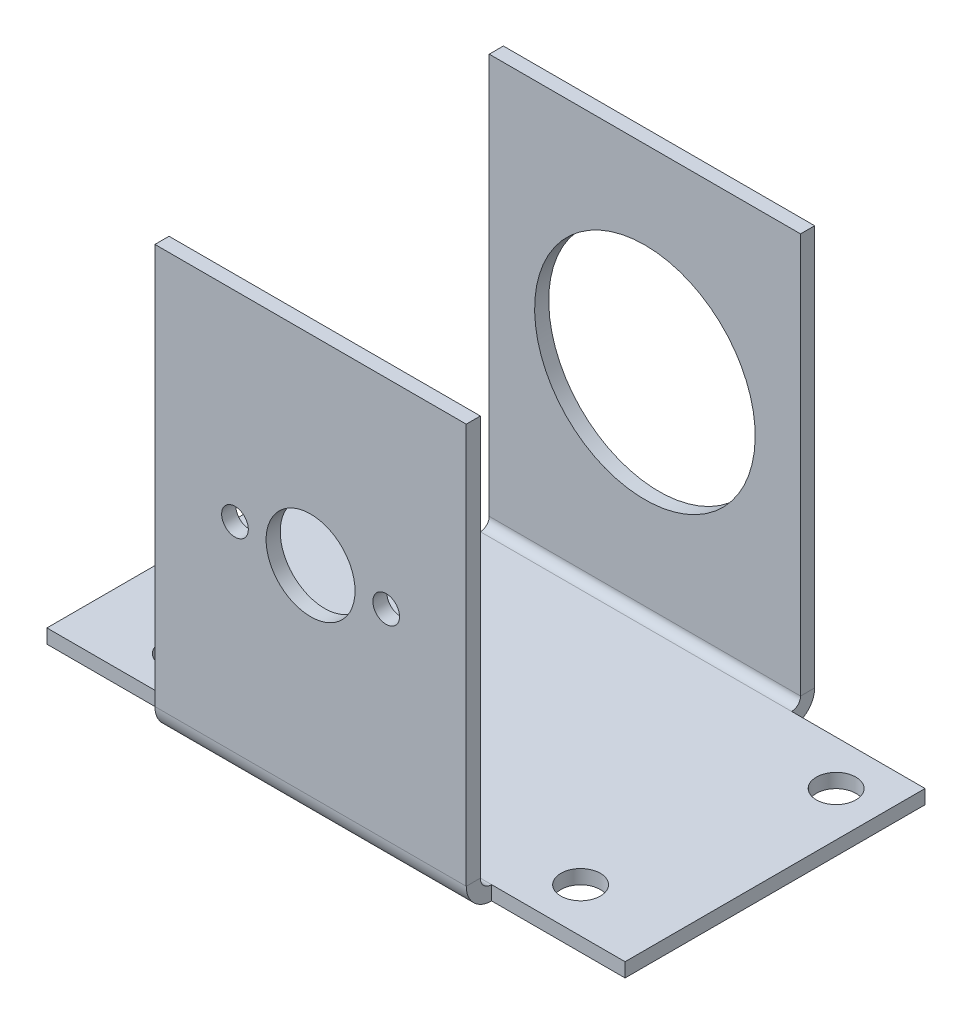
ISO-10303-21;
HEADER;
FILE_DESCRIPTION(('STEP AP214'),'2;1');
FILE_NAME('part.step','',(''),(''),'','','');
FILE_SCHEMA(('AUTOMOTIVE_DESIGN { 1 0 10303 214 1 1 1 1 }'));
ENDSEC;
DATA;
#1=APPLICATION_CONTEXT('core data for automotive mechanical design processes');
#2=APPLICATION_PROTOCOL_DEFINITION('international standard','automotive_design',2000,#1);
#3=PRODUCT_CONTEXT('',#1,'mechanical');
#4=PRODUCT('Part','Part','',(#3));
#5=PRODUCT_RELATED_PRODUCT_CATEGORY('part','',(#4));
#6=PRODUCT_DEFINITION_FORMATION('','',#4);
#7=PRODUCT_DEFINITION_CONTEXT('part definition',#1,'design');
#8=PRODUCT_DEFINITION('design','',#6,#7);
#9=PRODUCT_DEFINITION_SHAPE('','',#8);
#10=(LENGTH_UNIT() NAMED_UNIT(*) SI_UNIT(.MILLI.,.METRE.));
#11=(NAMED_UNIT(*) PLANE_ANGLE_UNIT() SI_UNIT($,.RADIAN.));
#12=(NAMED_UNIT(*) SI_UNIT($,.STERADIAN.) SOLID_ANGLE_UNIT());
#13=UNCERTAINTY_MEASURE_WITH_UNIT(LENGTH_MEASURE(1.E-05),#10,'distance_accuracy_value','');
#14=(GEOMETRIC_REPRESENTATION_CONTEXT(3) GLOBAL_UNCERTAINTY_ASSIGNED_CONTEXT((#13)) GLOBAL_UNIT_ASSIGNED_CONTEXT((#10,
#11,#12)) REPRESENTATION_CONTEXT('',''));
#15=CARTESIAN_POINT('',(0.,0.,0.));
#16=DIRECTION('',(0.,0.,1.));
#17=DIRECTION('',(1.,0.,0.));
#18=AXIS2_PLACEMENT_3D('',#15,#16,#17);
#19=CARTESIAN_POINT('',(17.5,22.5,0.79375));
#20=DIRECTION('',(1.,0.,0.));
#21=DIRECTION('',(0.,1.,0.));
#22=AXIS2_PLACEMENT_3D('',#19,#20,#21);
#23=PLANE('',#22);
#24=DIRECTION('',(0.,0.,1.));
#25=VECTOR('',#24,1.);
#26=CARTESIAN_POINT('',(17.5,-22.5,0.79375));
#27=LINE('',#26,#25);
#28=CARTESIAN_POINT('',(17.5,-22.5,-0.79375));
#29=VERTEX_POINT('',#28);
#30=CARTESIAN_POINT('',(17.5,-22.5,0.79375));
#31=VERTEX_POINT('',#30);
#32=EDGE_CURVE('E13',#29,#31,#27,.T.);
#33=ORIENTED_EDGE('',*,*,#32,.F.);
#34=DIRECTION('',(0.,1.,0.));
#35=VECTOR('',#34,1.);
#36=CARTESIAN_POINT('',(17.5,0.,-0.79375));
#37=LINE('',#36,#35);
#38=CARTESIAN_POINT('',(17.5,22.5,-0.79375));
#39=VERTEX_POINT('',#38);
#40=EDGE_CURVE('E313',#29,#39,#37,.T.);
#41=ORIENTED_EDGE('',*,*,#40,.T.);
#42=DIRECTION('',(0.,0.,1.));
#43=VECTOR('',#42,1.);
#44=CARTESIAN_POINT('',(17.5,22.5,0.79375));
#45=LINE('',#44,#43);
#46=CARTESIAN_POINT('',(17.5,22.5,0.79375));
#47=VERTEX_POINT('',#46);
#48=EDGE_CURVE('E95',#39,#47,#45,.T.);
#49=ORIENTED_EDGE('',*,*,#48,.T.);
#50=DIRECTION('',(0.,1.,0.));
#51=VECTOR('',#50,1.);
#52=CARTESIAN_POINT('',(17.5,22.5,0.79375));
#53=LINE('',#52,#51);
#54=EDGE_CURVE('E292',#31,#47,#53,.T.);
#55=ORIENTED_EDGE('',*,*,#54,.F.);
#56=EDGE_LOOP('',(#33,#41,#49,#55));
#57=FACE_BOUND('',#56,.T.);
#58=ADVANCED_FACE('F85',(#57),#23,.T.);
#59=CARTESIAN_POINT('',(-17.5,22.5,0.79375));
#60=DIRECTION('',(0.,1.,0.));
#61=DIRECTION('',(-1.,0.,0.));
#62=AXIS2_PLACEMENT_3D('',#59,#60,#61);
#63=PLANE('',#62);
#64=ORIENTED_EDGE('',*,*,#48,.F.);
#65=DIRECTION('',(1.,0.,0.));
#66=VECTOR('',#65,1.);
#67=CARTESIAN_POINT('',(0.,22.5,-0.79375));
#68=LINE('',#67,#66);
#69=CARTESIAN_POINT('',(-17.5,22.5,-0.79375));
#70=VERTEX_POINT('',#69);
#71=EDGE_CURVE('E310',#39,#70,#68,.F.);
#72=ORIENTED_EDGE('',*,*,#71,.T.);
#73=DIRECTION('',(0.,0.,1.));
#74=VECTOR('',#73,1.);
#75=CARTESIAN_POINT('',(-17.5,22.5,0.79375));
#76=LINE('',#75,#74);
#77=CARTESIAN_POINT('',(-17.5,22.5,0.79375));
#78=VERTEX_POINT('',#77);
#79=EDGE_CURVE('E104',#70,#78,#76,.T.);
#80=ORIENTED_EDGE('',*,*,#79,.T.);
#81=DIRECTION('',(-1.,0.,0.));
#82=VECTOR('',#81,1.);
#83=CARTESIAN_POINT('',(-17.5,22.5,0.79375));
#84=LINE('',#83,#82);
#85=EDGE_CURVE('E295',#47,#78,#84,.T.);
#86=ORIENTED_EDGE('',*,*,#85,.F.);
#87=EDGE_LOOP('',(#64,#72,#80,#86));
#88=FACE_BOUND('',#87,.T.);
#89=ADVANCED_FACE('F329',(#88),#63,.T.);
#90=CARTESIAN_POINT('',(-17.5,22.5,0.79375));
#91=DIRECTION('',(-1.,0.,0.));
#92=DIRECTION('',(0.,-1.,0.));
#93=AXIS2_PLACEMENT_3D('',#90,#91,#92);
#94=PLANE('',#93);
#95=ORIENTED_EDGE('',*,*,#79,.F.);
#96=DIRECTION('',(0.,1.,0.));
#97=VECTOR('',#96,1.);
#98=CARTESIAN_POINT('',(-17.5,0.,-0.79375));
#99=LINE('',#98,#97);
#100=CARTESIAN_POINT('',(-17.5,-22.5,-0.79375));
#101=VERTEX_POINT('',#100);
#102=EDGE_CURVE('E307',#70,#101,#99,.F.);
#103=ORIENTED_EDGE('',*,*,#102,.T.);
#104=DIRECTION('',(0.,0.,1.));
#105=VECTOR('',#104,1.);
#106=CARTESIAN_POINT('',(-17.5,-22.5,0.79375));
#107=LINE('',#106,#105);
#108=CARTESIAN_POINT('',(-17.5,-22.5,0.79375));
#109=VERTEX_POINT('',#108);
#110=EDGE_CURVE('E304',#101,#109,#107,.T.);
#111=ORIENTED_EDGE('',*,*,#110,.T.);
#112=DIRECTION('',(0.,-1.,0.));
#113=VECTOR('',#112,1.);
#114=CARTESIAN_POINT('',(-17.5,22.5,0.79375));
#115=LINE('',#114,#113);
#116=EDGE_CURVE('E287',#78,#109,#115,.T.);
#117=ORIENTED_EDGE('',*,*,#116,.F.);
#118=EDGE_LOOP('',(#95,#103,#111,#117));
#119=FACE_BOUND('',#118,.T.);
#120=ADVANCED_FACE('F322',(#119),#94,.T.);
#121=CARTESIAN_POINT('',(8.5,0.,0.79375));
#122=DIRECTION('',(0.,0.,1.));
#123=DIRECTION('',(1.,0.,0.));
#124=AXIS2_PLACEMENT_3D('',#121,#122,#123);
#125=CYLINDRICAL_SURFACE('',#124,1.5);
#126=CARTESIAN_POINT('',(8.5,0.,0.79375));
#127=DIRECTION('',(0.,0.,1.));
#128=DIRECTION('',(1.,0.,0.));
#129=AXIS2_PLACEMENT_3D('',#126,#127,#128);
#130=CIRCLE('',#129,1.5);
#131=CARTESIAN_POINT('',(10.,0.,0.79375));
#132=VERTEX_POINT('',#131);
#133=EDGE_CURVE('E284',#132,#132,#130,.T.);
#134=ORIENTED_EDGE('',*,*,#133,.T.);
#135=EDGE_LOOP('',(#134));
#136=FACE_BOUND('',#135,.T.);
#137=CARTESIAN_POINT('',(8.5,0.,-0.79375));
#138=DIRECTION('',(0.,0.,1.));
#139=DIRECTION('',(1.,0.,0.));
#140=AXIS2_PLACEMENT_3D('',#137,#138,#139);
#141=CIRCLE('',#140,1.5);
#142=CARTESIAN_POINT('',(10.,0.,-0.79375));
#143=VERTEX_POINT('',#142);
#144=EDGE_CURVE('E277',#143,#143,#141,.T.);
#145=ORIENTED_EDGE('',*,*,#144,.F.);
#146=EDGE_LOOP('',(#145));
#147=FACE_BOUND('',#146,.T.);
#148=ADVANCED_FACE('F336',(#136,#147),#125,.F.);
#149=CARTESIAN_POINT('',(-8.5,0.,0.79375));
#150=DIRECTION('',(0.,0.,1.));
#151=DIRECTION('',(1.,0.,0.));
#152=AXIS2_PLACEMENT_3D('',#149,#150,#151);
#153=CYLINDRICAL_SURFACE('',#152,1.5);
#154=CARTESIAN_POINT('',(-8.5,0.,0.79375));
#155=DIRECTION('',(0.,0.,1.));
#156=DIRECTION('',(1.,0.,0.));
#157=AXIS2_PLACEMENT_3D('',#154,#155,#156);
#158=CIRCLE('',#157,1.5);
#159=CARTESIAN_POINT('',(-7.,0.,0.79375));
#160=VERTEX_POINT('',#159);
#161=EDGE_CURVE('E298',#160,#160,#158,.T.);
#162=ORIENTED_EDGE('',*,*,#161,.T.);
#163=EDGE_LOOP('',(#162));
#164=FACE_BOUND('',#163,.T.);
#165=CARTESIAN_POINT('',(-8.5,0.,-0.79375));
#166=DIRECTION('',(0.,0.,1.));
#167=DIRECTION('',(1.,0.,0.));
#168=AXIS2_PLACEMENT_3D('',#165,#166,#167);
#169=CIRCLE('',#168,1.5);
#170=CARTESIAN_POINT('',(-7.,0.,-0.79375));
#171=VERTEX_POINT('',#170);
#172=EDGE_CURVE('E312',#171,#171,#169,.T.);
#173=ORIENTED_EDGE('',*,*,#172,.F.);
#174=EDGE_LOOP('',(#173));
#175=FACE_BOUND('',#174,.T.);
#176=ADVANCED_FACE('F341',(#164,#175),#153,.F.);
#177=CARTESIAN_POINT('',(0.,0.,0.79375));
#178=DIRECTION('',(0.,0.,1.));
#179=DIRECTION('',(1.,0.,0.));
#180=AXIS2_PLACEMENT_3D('',#177,#178,#179);
#181=CYLINDRICAL_SURFACE('',#180,5.);
#182=CARTESIAN_POINT('',(0.,0.,0.79375));
#183=DIRECTION('',(0.,0.,1.));
#184=DIRECTION('',(1.,0.,0.));
#185=AXIS2_PLACEMENT_3D('',#182,#183,#184);
#186=CIRCLE('',#185,5.);
#187=CARTESIAN_POINT('',(5.,0.,0.79375));
#188=VERTEX_POINT('',#187);
#189=EDGE_CURVE('E301',#188,#188,#186,.T.);
#190=ORIENTED_EDGE('',*,*,#189,.T.);
#191=EDGE_LOOP('',(#190));
#192=FACE_BOUND('',#191,.T.);
#193=CARTESIAN_POINT('',(0.,0.,-0.79375));
#194=DIRECTION('',(0.,0.,1.));
#195=DIRECTION('',(1.,0.,0.));
#196=AXIS2_PLACEMENT_3D('',#193,#194,#195);
#197=CIRCLE('',#196,5.);
#198=CARTESIAN_POINT('',(5.,0.,-0.79375));
#199=VERTEX_POINT('',#198);
#200=EDGE_CURVE('E288',#199,#199,#197,.T.);
#201=ORIENTED_EDGE('',*,*,#200,.F.);
#202=EDGE_LOOP('',(#201));
#203=FACE_BOUND('',#202,.T.);
#204=ADVANCED_FACE('F87',(#192,#203),#181,.F.);
#205=CARTESIAN_POINT('',(0.,0.,0.79375));
#206=DIRECTION('',(0.,0.,1.));
#207=DIRECTION('',(1.,0.,0.));
#208=AXIS2_PLACEMENT_3D('',#205,#206,#207);
#209=PLANE('',#208);
#210=ORIENTED_EDGE('',*,*,#133,.F.);
#211=EDGE_LOOP('',(#210));
#212=FACE_BOUND('',#211,.T.);
#213=ORIENTED_EDGE('',*,*,#116,.T.);
#214=DIRECTION('',(1.,0.,0.));
#215=VECTOR('',#214,1.);
#216=CARTESIAN_POINT('',(-17.5,-22.5,0.79375));
#217=LINE('',#216,#215);
#218=EDGE_CURVE('E124',#109,#31,#217,.T.);
#219=ORIENTED_EDGE('',*,*,#218,.T.);
#220=ORIENTED_EDGE('',*,*,#54,.T.);
#221=ORIENTED_EDGE('',*,*,#85,.T.);
#222=EDGE_LOOP('',(#213,#219,#220,#221));
#223=FACE_BOUND('',#222,.T.);
#224=ORIENTED_EDGE('',*,*,#161,.F.);
#225=EDGE_LOOP('',(#224));
#226=FACE_BOUND('',#225,.T.);
#227=ORIENTED_EDGE('',*,*,#189,.F.);
#228=EDGE_LOOP('',(#227));
#229=FACE_BOUND('',#228,.T.);
#230=ADVANCED_FACE('F326',(#212,#223,#226,#229),#209,.T.);
#231=CARTESIAN_POINT('',(0.,0.,-0.79375));
#232=DIRECTION('',(0.,0.,1.));
#233=DIRECTION('',(1.,0.,0.));
#234=AXIS2_PLACEMENT_3D('',#231,#232,#233);
#235=PLANE('',#234);
#236=ORIENTED_EDGE('',*,*,#144,.T.);
#237=EDGE_LOOP('',(#236));
#238=FACE_BOUND('',#237,.T.);
#239=ORIENTED_EDGE('',*,*,#102,.F.);
#240=ORIENTED_EDGE('',*,*,#71,.F.);
#241=ORIENTED_EDGE('',*,*,#40,.F.);
#242=DIRECTION('',(1.,0.,0.));
#243=VECTOR('',#242,1.);
#244=CARTESIAN_POINT('',(0.,-22.5,-0.79375));
#245=LINE('',#244,#243);
#246=EDGE_CURVE('E309',#101,#29,#245,.T.);
#247=ORIENTED_EDGE('',*,*,#246,.F.);
#248=EDGE_LOOP('',(#239,#240,#241,#247));
#249=FACE_BOUND('',#248,.T.);
#250=ORIENTED_EDGE('',*,*,#172,.T.);
#251=EDGE_LOOP('',(#250));
#252=FACE_BOUND('',#251,.T.);
#253=ORIENTED_EDGE('',*,*,#200,.T.);
#254=EDGE_LOOP('',(#253));
#255=FACE_BOUND('',#254,.T.);
#256=ADVANCED_FACE('F354',(#238,#249,#252,#255),#235,.F.);
#257=CARTESIAN_POINT('',(17.5,-22.5,-2.06375));
#258=DIRECTION('',(1.,0.,0.));
#259=DIRECTION('',(0.,0.,-1.));
#260=AXIS2_PLACEMENT_3D('',#257,#258,#259);
#261=PLANE('',#260);
#262=DIRECTION('',(0.,1.,0.));
#263=VECTOR('',#262,1.);
#264=CARTESIAN_POINT('',(17.5,-25.3575,-2.06374999999999));
#265=LINE('',#264,#263);
#266=CARTESIAN_POINT('',(17.5,-23.77,-2.06375));
#267=VERTEX_POINT('',#266);
#268=CARTESIAN_POINT('',(17.5,-25.3575,-2.06374999999999));
#269=VERTEX_POINT('',#268);
#270=EDGE_CURVE('E143',#267,#269,#265,.F.);
#271=ORIENTED_EDGE('',*,*,#270,.F.);
#272=CARTESIAN_POINT('',(17.5,-22.5,-2.06375));
#273=DIRECTION('',(-1.,0.,0.));
#274=DIRECTION('',(0.,0.,1.));
#275=AXIS2_PLACEMENT_3D('',#272,#273,#274);
#276=CIRCLE('',#275,1.27);
#277=EDGE_CURVE('E280',#29,#267,#276,.F.);
#278=ORIENTED_EDGE('',*,*,#277,.F.);
#279=ORIENTED_EDGE('',*,*,#32,.T.);
#280=CARTESIAN_POINT('',(17.5,-22.5,-2.06375));
#281=DIRECTION('',(-1.,0.,0.));
#282=DIRECTION('',(0.,0.,1.));
#283=AXIS2_PLACEMENT_3D('',#280,#281,#282);
#284=CIRCLE('',#283,2.8575);
#285=EDGE_CURVE('E275',#31,#269,#284,.F.);
#286=ORIENTED_EDGE('',*,*,#285,.T.);
#287=EDGE_LOOP('',(#271,#278,#279,#286));
#288=FACE_BOUND('',#287,.T.);
#289=ADVANCED_FACE('F357',(#288),#261,.T.);
#290=CARTESIAN_POINT('',(-17.5,-22.5,-2.06375));
#291=DIRECTION('',(1.,0.,0.));
#292=DIRECTION('',(0.,0.,-1.));
#293=AXIS2_PLACEMENT_3D('',#290,#291,#292);
#294=PLANE('',#293);
#295=CARTESIAN_POINT('',(-17.5,-22.5,-2.06375));
#296=DIRECTION('',(-1.,0.,0.));
#297=DIRECTION('',(0.,0.,1.));
#298=AXIS2_PLACEMENT_3D('',#295,#296,#297);
#299=CIRCLE('',#298,1.27);
#300=CARTESIAN_POINT('',(-17.5,-23.77,-2.06375));
#301=VERTEX_POINT('',#300);
#302=EDGE_CURVE('E227',#301,#101,#299,.T.);
#303=ORIENTED_EDGE('',*,*,#302,.F.);
#304=DIRECTION('',(0.,1.,0.));
#305=VECTOR('',#304,1.);
#306=CARTESIAN_POINT('',(-17.5,-23.77,-2.06375));
#307=LINE('',#306,#305);
#308=CARTESIAN_POINT('',(-17.5,-25.3575,-2.06374999999999));
#309=VERTEX_POINT('',#308);
#310=EDGE_CURVE('E268',#301,#309,#307,.F.);
#311=ORIENTED_EDGE('',*,*,#310,.T.);
#312=CARTESIAN_POINT('',(-17.5,-22.5,-2.06375));
#313=DIRECTION('',(-1.,0.,0.));
#314=DIRECTION('',(0.,0.,1.));
#315=AXIS2_PLACEMENT_3D('',#312,#313,#314);
#316=CIRCLE('',#315,2.8575);
#317=EDGE_CURVE('E278',#309,#109,#316,.T.);
#318=ORIENTED_EDGE('',*,*,#317,.T.);
#319=ORIENTED_EDGE('',*,*,#110,.F.);
#320=EDGE_LOOP('',(#303,#311,#318,#319));
#321=FACE_BOUND('',#320,.T.);
#322=ADVANCED_FACE('F366',(#321),#294,.F.);
#323=CARTESIAN_POINT('',(-17.5,-22.5,-2.06375));
#324=DIRECTION('',(-1.,0.,0.));
#325=DIRECTION('',(0.,-1.,0.));
#326=AXIS2_PLACEMENT_3D('',#323,#324,#325);
#327=CYLINDRICAL_SURFACE('',#326,2.8575);
#328=ORIENTED_EDGE('',*,*,#218,.F.);
#329=ORIENTED_EDGE('',*,*,#317,.F.);
#330=DIRECTION('',(-1.,0.,0.));
#331=VECTOR('',#330,1.);
#332=CARTESIAN_POINT('',(17.5,-25.3575,-2.06374999999999));
#333=LINE('',#332,#331);
#334=EDGE_CURVE('E266',#309,#269,#333,.F.);
#335=ORIENTED_EDGE('',*,*,#334,.T.);
#336=ORIENTED_EDGE('',*,*,#285,.F.);
#337=EDGE_LOOP('',(#328,#329,#335,#336));
#338=FACE_BOUND('',#337,.T.);
#339=ADVANCED_FACE('F373',(#338),#327,.T.);
#340=CARTESIAN_POINT('',(-17.5,-22.5,-2.06375));
#341=DIRECTION('',(-1.,0.,0.));
#342=DIRECTION('',(0.,-1.,0.));
#343=AXIS2_PLACEMENT_3D('',#340,#341,#342);
#344=CYLINDRICAL_SURFACE('',#343,1.27);
#345=ORIENTED_EDGE('',*,*,#246,.T.);
#346=ORIENTED_EDGE('',*,*,#277,.T.);
#347=DIRECTION('',(-1.,0.,0.));
#348=VECTOR('',#347,1.);
#349=CARTESIAN_POINT('',(17.5,-23.77,-2.06375));
#350=LINE('',#349,#348);
#351=EDGE_CURVE('E271',#267,#301,#350,.T.);
#352=ORIENTED_EDGE('',*,*,#351,.T.);
#353=ORIENTED_EDGE('',*,*,#302,.T.);
#354=EDGE_LOOP('',(#345,#346,#352,#353));
#355=FACE_BOUND('',#354,.T.);
#356=ADVANCED_FACE('F375',(#355),#344,.F.);
#357=CARTESIAN_POINT('',(0.,-25.3575,0.));
#358=DIRECTION('',(0.,1.,0.));
#359=DIRECTION('',(0.,0.,1.));
#360=AXIS2_PLACEMENT_3D('',#357,#358,#359);
#361=PLANE('',#360);
#362=CARTESIAN_POINT('',(-22.5,-25.3575,-7.06374999999999));
#363=DIRECTION('',(0.,1.,0.));
#364=DIRECTION('',(0.,0.,1.));
#365=AXIS2_PLACEMENT_3D('',#362,#363,#364);
#366=CIRCLE('',#365,2.2225);
#367=CARTESIAN_POINT('',(-22.5,-25.3575,-4.84124999999999));
#368=VERTEX_POINT('',#367);
#369=EDGE_CURVE('E469',#368,#368,#366,.F.);
#370=ORIENTED_EDGE('',*,*,#369,.F.);
#371=EDGE_LOOP('',(#370));
#372=FACE_BOUND('',#371,.T.);
#373=CARTESIAN_POINT('',(-27.5,-25.3575000000001,-30.79375));
#374=DIRECTION('',(0.,1.,0.));
#375=DIRECTION('',(0.,0.,1.));
#376=AXIS2_PLACEMENT_3D('',#373,#374,#375);
#377=CIRCLE('',#376,2.2225);
#378=CARTESIAN_POINT('',(-27.5,-25.3575000000001,-28.57125));
#379=VERTEX_POINT('',#378);
#380=EDGE_CURVE('E471',#379,#379,#377,.F.);
#381=ORIENTED_EDGE('',*,*,#380,.F.);
#382=EDGE_LOOP('',(#381));
#383=FACE_BOUND('',#382,.T.);
#384=CARTESIAN_POINT('',(22.5,-25.3575,-7.06374999999999));
#385=DIRECTION('',(0.,1.,0.));
#386=DIRECTION('',(0.,0.,1.));
#387=AXIS2_PLACEMENT_3D('',#384,#385,#386);
#388=CIRCLE('',#387,2.2225);
#389=CARTESIAN_POINT('',(22.5,-25.3575,-4.84124999999999));
#390=VERTEX_POINT('',#389);
#391=EDGE_CURVE('E485',#390,#390,#388,.T.);
#392=ORIENTED_EDGE('',*,*,#391,.T.);
#393=EDGE_LOOP('',(#392));
#394=FACE_BOUND('',#393,.T.);
#395=CARTESIAN_POINT('',(27.5,-25.3575000000001,-30.79375));
#396=DIRECTION('',(0.,1.,0.));
#397=DIRECTION('',(0.,0.,1.));
#398=AXIS2_PLACEMENT_3D('',#395,#396,#397);
#399=CIRCLE('',#398,2.2225);
#400=CARTESIAN_POINT('',(27.5,-25.3575000000001,-28.57125));
#401=VERTEX_POINT('',#400);
#402=EDGE_CURVE('E481',#401,#401,#399,.T.);
#403=ORIENTED_EDGE('',*,*,#402,.T.);
#404=EDGE_LOOP('',(#403));
#405=FACE_BOUND('',#404,.T.);
#406=ORIENTED_EDGE('',*,*,#334,.F.);
#407=DIRECTION('',(1.,0.,0.));
#408=VECTOR('',#407,1.);
#409=CARTESIAN_POINT('',(-17.5,-25.3575,-2.06374999999999));
#410=LINE('',#409,#408);
#411=CARTESIAN_POINT('',(-32.5,-25.3575,-2.06374999999999));
#412=VERTEX_POINT('',#411);
#413=EDGE_CURVE('E489',#412,#309,#410,.T.);
#414=ORIENTED_EDGE('',*,*,#413,.F.);
#415=DIRECTION('',(0.,0.,1.));
#416=VECTOR('',#415,1.);
#417=CARTESIAN_POINT('',(-32.5,-25.3575,-2.06374999999999));
#418=LINE('',#417,#416);
#419=CARTESIAN_POINT('',(-32.5,-25.3575000000001,-35.79375));
#420=VERTEX_POINT('',#419);
#421=EDGE_CURVE('E240',#420,#412,#418,.T.);
#422=ORIENTED_EDGE('',*,*,#421,.F.);
#423=DIRECTION('',(-1.,0.,0.));
#424=VECTOR('',#423,1.);
#425=CARTESIAN_POINT('',(-17.5,-25.3575000000001,-35.79375));
#426=LINE('',#425,#424);
#427=CARTESIAN_POINT('',(-17.5,-25.3575000000001,-35.79375));
#428=VERTEX_POINT('',#427);
#429=EDGE_CURVE('E220',#428,#420,#426,.T.);
#430=ORIENTED_EDGE('',*,*,#429,.F.);
#431=DIRECTION('',(1.,0.,0.));
#432=VECTOR('',#431,1.);
#433=CARTESIAN_POINT('',(0.,-25.3575000000001,-35.79375));
#434=LINE('',#433,#432);
#435=CARTESIAN_POINT('',(17.5,-25.3575000000001,-35.79375));
#436=VERTEX_POINT('',#435);
#437=EDGE_CURVE('E236',#428,#436,#434,.T.);
#438=ORIENTED_EDGE('',*,*,#437,.T.);
#439=DIRECTION('',(-1.,0.,0.));
#440=VECTOR('',#439,1.);
#441=CARTESIAN_POINT('',(17.5,-25.3575000000001,-35.79375));
#442=LINE('',#441,#440);
#443=CARTESIAN_POINT('',(32.5,-25.3575000000001,-35.79375));
#444=VERTEX_POINT('',#443);
#445=EDGE_CURVE('E509',#444,#436,#442,.T.);
#446=ORIENTED_EDGE('',*,*,#445,.F.);
#447=DIRECTION('',(0.,0.,-1.));
#448=VECTOR('',#447,1.);
#449=CARTESIAN_POINT('',(32.5,-25.3575,-2.06375000000001));
#450=LINE('',#449,#448);
#451=CARTESIAN_POINT('',(32.5,-25.3575,-2.06375000000001));
#452=VERTEX_POINT('',#451);
#453=EDGE_CURVE('E505',#452,#444,#450,.T.);
#454=ORIENTED_EDGE('',*,*,#453,.F.);
#455=DIRECTION('',(1.,0.,0.));
#456=VECTOR('',#455,1.);
#457=CARTESIAN_POINT('',(17.5,-25.3575,-2.06375));
#458=LINE('',#457,#456);
#459=EDGE_CURVE('E502',#269,#452,#458,.T.);
#460=ORIENTED_EDGE('',*,*,#459,.F.);
#461=EDGE_LOOP('',(#406,#414,#422,#430,#438,#446,#454,#460));
#462=FACE_BOUND('',#461,.T.);
#463=ADVANCED_FACE('F234',(#372,#383,#394,#405,#462),#361,.F.);
#464=CARTESIAN_POINT('',(0.,-23.77,0.));
#465=DIRECTION('',(0.,1.,0.));
#466=DIRECTION('',(0.,0.,1.));
#467=AXIS2_PLACEMENT_3D('',#464,#465,#466);
#468=PLANE('',#467);
#469=CARTESIAN_POINT('',(-22.5,-23.77,-7.06374999999999));
#470=DIRECTION('',(0.,-1.,0.));
#471=DIRECTION('',(0.,0.,1.));
#472=AXIS2_PLACEMENT_3D('',#469,#470,#471);
#473=CIRCLE('',#472,2.2225);
#474=CARTESIAN_POINT('',(-22.5,-23.77,-4.84125));
#475=VERTEX_POINT('',#474);
#476=EDGE_CURVE('E466',#475,#475,#473,.T.);
#477=ORIENTED_EDGE('',*,*,#476,.T.);
#478=EDGE_LOOP('',(#477));
#479=FACE_BOUND('',#478,.T.);
#480=CARTESIAN_POINT('',(-27.5,-23.7700000000001,-30.79375));
#481=DIRECTION('',(0.,-1.,0.));
#482=DIRECTION('',(0.,0.,1.));
#483=AXIS2_PLACEMENT_3D('',#480,#481,#482);
#484=CIRCLE('',#483,2.2225);
#485=CARTESIAN_POINT('',(-27.5,-23.7700000000001,-28.57125));
#486=VERTEX_POINT('',#485);
#487=EDGE_CURVE('E589',#486,#486,#484,.T.);
#488=ORIENTED_EDGE('',*,*,#487,.T.);
#489=EDGE_LOOP('',(#488));
#490=FACE_BOUND('',#489,.T.);
#491=CARTESIAN_POINT('',(22.5,-23.77,-7.06374999999999));
#492=DIRECTION('',(0.,1.,0.));
#493=DIRECTION('',(0.,0.,1.));
#494=AXIS2_PLACEMENT_3D('',#491,#492,#493);
#495=CIRCLE('',#494,2.2225);
#496=CARTESIAN_POINT('',(22.5,-23.77,-4.84125));
#497=VERTEX_POINT('',#496);
#498=EDGE_CURVE('E474',#497,#497,#495,.T.);
#499=ORIENTED_EDGE('',*,*,#498,.F.);
#500=EDGE_LOOP('',(#499));
#501=FACE_BOUND('',#500,.T.);
#502=CARTESIAN_POINT('',(27.5,-23.7700000000001,-30.79375));
#503=DIRECTION('',(0.,1.,0.));
#504=DIRECTION('',(0.,0.,1.));
#505=AXIS2_PLACEMENT_3D('',#502,#503,#504);
#506=CIRCLE('',#505,2.2225);
#507=CARTESIAN_POINT('',(27.5,-23.7700000000001,-28.57125));
#508=VERTEX_POINT('',#507);
#509=EDGE_CURVE('E470',#508,#508,#506,.T.);
#510=ORIENTED_EDGE('',*,*,#509,.F.);
#511=EDGE_LOOP('',(#510));
#512=FACE_BOUND('',#511,.T.);
#513=DIRECTION('',(-1.,0.,0.));
#514=VECTOR('',#513,1.);
#515=CARTESIAN_POINT('',(17.5,-23.7700000000001,-35.79375));
#516=LINE('',#515,#514);
#517=CARTESIAN_POINT('',(-17.5,-23.7700000000001,-35.79375));
#518=VERTEX_POINT('',#517);
#519=CARTESIAN_POINT('',(17.5,-23.7700000000001,-35.79375));
#520=VERTEX_POINT('',#519);
#521=EDGE_CURVE('E246',#518,#520,#516,.F.);
#522=ORIENTED_EDGE('',*,*,#521,.F.);
#523=DIRECTION('',(-1.,0.,0.));
#524=VECTOR('',#523,1.);
#525=CARTESIAN_POINT('',(-17.5,-23.7700000000001,-35.79375));
#526=LINE('',#525,#524);
#527=CARTESIAN_POINT('',(-32.5,-23.7700000000001,-35.79375));
#528=VERTEX_POINT('',#527);
#529=EDGE_CURVE('E222',#518,#528,#526,.T.);
#530=ORIENTED_EDGE('',*,*,#529,.T.);
#531=DIRECTION('',(0.,0.,1.));
#532=VECTOR('',#531,1.);
#533=CARTESIAN_POINT('',(-32.5,-23.77,-2.06375));
#534=LINE('',#533,#532);
#535=CARTESIAN_POINT('',(-32.5,-23.77,-2.06375));
#536=VERTEX_POINT('',#535);
#537=EDGE_CURVE('E493',#528,#536,#534,.T.);
#538=ORIENTED_EDGE('',*,*,#537,.T.);
#539=DIRECTION('',(1.,0.,0.));
#540=VECTOR('',#539,1.);
#541=CARTESIAN_POINT('',(-17.5,-23.77,-2.06375));
#542=LINE('',#541,#540);
#543=EDGE_CURVE('E241',#536,#301,#542,.T.);
#544=ORIENTED_EDGE('',*,*,#543,.T.);
#545=ORIENTED_EDGE('',*,*,#351,.F.);
#546=DIRECTION('',(1.,0.,0.));
#547=VECTOR('',#546,1.);
#548=CARTESIAN_POINT('',(17.5,-23.77,-2.06375));
#549=LINE('',#548,#547);
#550=CARTESIAN_POINT('',(32.5,-23.77,-2.06375000000001));
#551=VERTEX_POINT('',#550);
#552=EDGE_CURVE('E500',#267,#551,#549,.T.);
#553=ORIENTED_EDGE('',*,*,#552,.T.);
#554=DIRECTION('',(0.,0.,-1.));
#555=VECTOR('',#554,1.);
#556=CARTESIAN_POINT('',(32.5,-23.77,-2.06375000000001));
#557=LINE('',#556,#555);
#558=CARTESIAN_POINT('',(32.5,-23.7700000000001,-35.79375));
#559=VERTEX_POINT('',#558);
#560=EDGE_CURVE('E514',#551,#559,#557,.T.);
#561=ORIENTED_EDGE('',*,*,#560,.T.);
#562=DIRECTION('',(-1.,0.,0.));
#563=VECTOR('',#562,1.);
#564=CARTESIAN_POINT('',(17.5,-23.7700000000001,-35.79375));
#565=LINE('',#564,#563);
#566=EDGE_CURVE('E506',#559,#520,#565,.T.);
#567=ORIENTED_EDGE('',*,*,#566,.T.);
#568=EDGE_LOOP('',(#522,#530,#538,#544,#545,#553,#561,#567));
#569=FACE_BOUND('',#568,.T.);
#570=ADVANCED_FACE('F381',(#479,#490,#501,#512,#569),#468,.T.);
#571=CARTESIAN_POINT('',(17.5,-22.7700000000001,-35.79375));
#572=DIRECTION('',(1.,0.,0.));
#573=DIRECTION('',(0.,0.,-1.));
#574=AXIS2_PLACEMENT_3D('',#571,#572,#573);
#575=PLANE('',#574);
#576=DIRECTION('',(0.,0.,1.));
#577=VECTOR('',#576,1.);
#578=CARTESIAN_POINT('',(17.5,-22.7700000000001,-38.3812500000006));
#579=LINE('',#578,#577);
#580=CARTESIAN_POINT('',(17.5,-22.7700000000001,-36.79375));
#581=VERTEX_POINT('',#580);
#582=CARTESIAN_POINT('',(17.5,-22.7700000000002,-38.38125));
#583=VERTEX_POINT('',#582);
#584=EDGE_CURVE('E548',#581,#583,#579,.F.);
#585=ORIENTED_EDGE('',*,*,#584,.F.);
#586=CARTESIAN_POINT('',(17.5,-22.7700000000001,-35.79375));
#587=DIRECTION('',(-1.,0.,0.));
#588=DIRECTION('',(0.,0.,1.));
#589=AXIS2_PLACEMENT_3D('',#586,#587,#588);
#590=CIRCLE('',#589,0.999999999999994);
#591=EDGE_CURVE('E252',#520,#581,#590,.F.);
#592=ORIENTED_EDGE('',*,*,#591,.F.);
#593=DIRECTION('',(0.,1.,0.));
#594=VECTOR('',#593,1.);
#595=CARTESIAN_POINT('',(17.5,-25.3575000000001,-35.79375));
#596=LINE('',#595,#594);
#597=EDGE_CURVE('E228',#436,#520,#596,.T.);
#598=ORIENTED_EDGE('',*,*,#597,.F.);
#599=CARTESIAN_POINT('',(17.5,-22.7700000000001,-35.79375));
#600=DIRECTION('',(-1.,0.,0.));
#601=DIRECTION('',(0.,0.,1.));
#602=AXIS2_PLACEMENT_3D('',#599,#600,#601);
#603=CIRCLE('',#602,2.58749999999999);
#604=EDGE_CURVE('E151',#436,#583,#603,.F.);
#605=ORIENTED_EDGE('',*,*,#604,.T.);
#606=EDGE_LOOP('',(#585,#592,#598,#605));
#607=FACE_BOUND('',#606,.T.);
#608=ADVANCED_FACE('F384',(#607),#575,.T.);
#609=CARTESIAN_POINT('',(-17.5,-22.7700000000001,-35.79375));
#610=DIRECTION('',(1.,0.,0.));
#611=DIRECTION('',(0.,0.,-1.));
#612=AXIS2_PLACEMENT_3D('',#609,#610,#611);
#613=PLANE('',#612);
#614=CARTESIAN_POINT('',(-17.5,-22.7700000000001,-35.79375));
#615=DIRECTION('',(-1.,0.,0.));
#616=DIRECTION('',(0.,0.,1.));
#617=AXIS2_PLACEMENT_3D('',#614,#615,#616);
#618=CIRCLE('',#617,0.999999999999994);
#619=CARTESIAN_POINT('',(-17.5,-22.7700000000001,-36.79375));
#620=VERTEX_POINT('',#619);
#621=EDGE_CURVE('E256',#620,#518,#618,.T.);
#622=ORIENTED_EDGE('',*,*,#621,.F.);
#623=DIRECTION('',(0.,0.,1.));
#624=VECTOR('',#623,1.);
#625=CARTESIAN_POINT('',(-17.5,-22.7700000000001,-36.79375));
#626=LINE('',#625,#624);
#627=CARTESIAN_POINT('',(-17.5,-22.7700000000001,-38.38125));
#628=VERTEX_POINT('',#627);
#629=EDGE_CURVE('E250',#620,#628,#626,.F.);
#630=ORIENTED_EDGE('',*,*,#629,.T.);
#631=CARTESIAN_POINT('',(-17.5,-22.7700000000001,-35.79375));
#632=DIRECTION('',(-1.,0.,0.));
#633=DIRECTION('',(0.,0.,1.));
#634=AXIS2_PLACEMENT_3D('',#631,#632,#633);
#635=CIRCLE('',#634,2.58749999999999);
#636=EDGE_CURVE('E244',#628,#428,#635,.T.);
#637=ORIENTED_EDGE('',*,*,#636,.T.);
#638=DIRECTION('',(0.,1.,0.));
#639=VECTOR('',#638,1.);
#640=CARTESIAN_POINT('',(-17.5,-25.3575000000001,-35.79375));
#641=LINE('',#640,#639);
#642=EDGE_CURVE('E217',#428,#518,#641,.T.);
#643=ORIENTED_EDGE('',*,*,#642,.T.);
#644=EDGE_LOOP('',(#622,#630,#637,#643));
#645=FACE_BOUND('',#644,.T.);
#646=ADVANCED_FACE('F248',(#645),#613,.F.);
#647=CARTESIAN_POINT('',(-17.5,-22.7700000000001,-35.79375));
#648=DIRECTION('',(-1.,0.,0.));
#649=DIRECTION('',(0.,0.,-1.));
#650=AXIS2_PLACEMENT_3D('',#647,#648,#649);
#651=CYLINDRICAL_SURFACE('',#650,2.58749999999999);
#652=ORIENTED_EDGE('',*,*,#437,.F.);
#653=ORIENTED_EDGE('',*,*,#636,.F.);
#654=DIRECTION('',(-1.,0.,0.));
#655=VECTOR('',#654,1.);
#656=CARTESIAN_POINT('',(0.,-22.7700000000001,-38.38125));
#657=LINE('',#656,#655);
#658=EDGE_CURVE('E544',#583,#628,#657,.T.);
#659=ORIENTED_EDGE('',*,*,#658,.F.);
#660=ORIENTED_EDGE('',*,*,#604,.F.);
#661=EDGE_LOOP('',(#652,#653,#659,#660));
#662=FACE_BOUND('',#661,.T.);
#663=ADVANCED_FACE('F243',(#662),#651,.T.);
#664=CARTESIAN_POINT('',(-17.5,-22.7700000000001,-35.79375));
#665=DIRECTION('',(-1.,0.,0.));
#666=DIRECTION('',(0.,0.,-1.));
#667=AXIS2_PLACEMENT_3D('',#664,#665,#666);
#668=CYLINDRICAL_SURFACE('',#667,0.999999999999994);
#669=ORIENTED_EDGE('',*,*,#521,.T.);
#670=ORIENTED_EDGE('',*,*,#591,.T.);
#671=DIRECTION('',(1.,0.,0.));
#672=VECTOR('',#671,1.);
#673=CARTESIAN_POINT('',(17.5,-22.7700000000001,-36.79375));
#674=LINE('',#673,#672);
#675=EDGE_CURVE('E547',#581,#620,#674,.F.);
#676=ORIENTED_EDGE('',*,*,#675,.T.);
#677=ORIENTED_EDGE('',*,*,#621,.T.);
#678=EDGE_LOOP('',(#669,#670,#676,#677));
#679=FACE_BOUND('',#678,.T.);
#680=ADVANCED_FACE('F394',(#679),#668,.F.);
#681=CARTESIAN_POINT('',(-17.5,-23.7700000000001,-38.38125));
#682=DIRECTION('',(1.,0.,0.));
#683=DIRECTION('',(0.,0.,-1.));
#684=AXIS2_PLACEMENT_3D('',#681,#682,#683);
#685=PLANE('',#684);
#686=ORIENTED_EDGE('',*,*,#629,.F.);
#687=DIRECTION('',(0.,1.,0.));
#688=VECTOR('',#687,1.);
#689=CARTESIAN_POINT('',(-17.5,-23.7700000000001,-36.79375));
#690=LINE('',#689,#688);
#691=CARTESIAN_POINT('',(-17.5,22.2299999999999,-36.7937500000003));
#692=VERTEX_POINT('',#691);
#693=EDGE_CURVE('E542',#620,#692,#690,.T.);
#694=ORIENTED_EDGE('',*,*,#693,.T.);
#695=DIRECTION('',(0.,0.,1.));
#696=VECTOR('',#695,1.);
#697=CARTESIAN_POINT('',(-17.5,22.2299999999999,-38.3812500000003));
#698=LINE('',#697,#696);
#699=CARTESIAN_POINT('',(-17.5,22.2299999999999,-38.3812500000003));
#700=VERTEX_POINT('',#699);
#701=EDGE_CURVE('E260',#700,#692,#698,.T.);
#702=ORIENTED_EDGE('',*,*,#701,.F.);
#703=DIRECTION('',(0.,-1.,0.));
#704=VECTOR('',#703,1.);
#705=CARTESIAN_POINT('',(-17.5,-2.62888954286574E-13,-38.3812500000002));
#706=LINE('',#705,#704);
#707=EDGE_CURVE('E535',#628,#700,#706,.F.);
#708=ORIENTED_EDGE('',*,*,#707,.F.);
#709=EDGE_LOOP('',(#686,#694,#702,#708));
#710=FACE_BOUND('',#709,.T.);
#711=ADVANCED_FACE('F397',(#710),#685,.F.);
#712=CARTESIAN_POINT('',(17.5,22.2299999999999,-38.3812500000003));
#713=DIRECTION('',(-1.,0.,0.));
#714=DIRECTION('',(0.,-1.,0.));
#715=AXIS2_PLACEMENT_3D('',#712,#713,#714);
#716=PLANE('',#715);
#717=ORIENTED_EDGE('',*,*,#584,.T.);
#718=DIRECTION('',(0.,1.,0.));
#719=VECTOR('',#718,1.);
#720=CARTESIAN_POINT('',(17.5,-2.65528750880452E-13,-38.3812500000002));
#721=LINE('',#720,#719);
#722=CARTESIAN_POINT('',(17.5,22.2299999999999,-38.3812500000003));
#723=VERTEX_POINT('',#722);
#724=EDGE_CURVE('E530',#723,#583,#721,.F.);
#725=ORIENTED_EDGE('',*,*,#724,.F.);
#726=DIRECTION('',(0.,0.,1.));
#727=VECTOR('',#726,1.);
#728=CARTESIAN_POINT('',(17.5,22.2299999999999,-38.3812500000003));
#729=LINE('',#728,#727);
#730=CARTESIAN_POINT('',(17.5,22.2299999999999,-36.7937500000003));
#731=VERTEX_POINT('',#730);
#732=EDGE_CURVE('E527',#723,#731,#729,.T.);
#733=ORIENTED_EDGE('',*,*,#732,.T.);
#734=DIRECTION('',(0.,-1.,0.));
#735=VECTOR('',#734,1.);
#736=CARTESIAN_POINT('',(17.5,22.2299999999999,-36.7937500000003));
#737=LINE('',#736,#735);
#738=EDGE_CURVE('E537',#731,#581,#737,.T.);
#739=ORIENTED_EDGE('',*,*,#738,.T.);
#740=EDGE_LOOP('',(#717,#725,#733,#739));
#741=FACE_BOUND('',#740,.T.);
#742=ADVANCED_FACE('F403',(#741),#716,.F.);
#743=CARTESIAN_POINT('',(0.,-2.62888954286574E-13,-38.3812500000002));
#744=DIRECTION('',(0.,0.,-1.));
#745=DIRECTION('',(0.,1.,0.));
#746=AXIS2_PLACEMENT_3D('',#743,#744,#745);
#747=PLANE('',#746);
#748=CARTESIAN_POINT('',(0.,-2.6632342164934E-13,-38.3812500000002));
#749=DIRECTION('',(0.,0.,-1.));
#750=DIRECTION('',(0.,1.,0.));
#751=AXIS2_PLACEMENT_3D('',#748,#749,#750);
#752=CIRCLE('',#751,12.4);
#753=CARTESIAN_POINT('',(0.,12.3999999999997,-38.3812500000003));
#754=VERTEX_POINT('',#753);
#755=EDGE_CURVE('E521',#754,#754,#752,.T.);
#756=ORIENTED_EDGE('',*,*,#755,.F.);
#757=EDGE_LOOP('',(#756));
#758=FACE_BOUND('',#757,.T.);
#759=ORIENTED_EDGE('',*,*,#724,.T.);
#760=ORIENTED_EDGE('',*,*,#658,.T.);
#761=ORIENTED_EDGE('',*,*,#707,.T.);
#762=DIRECTION('',(-1.,0.,0.));
#763=VECTOR('',#762,1.);
#764=CARTESIAN_POINT('',(0.,22.2299999999999,-38.3812500000003));
#765=LINE('',#764,#763);
#766=EDGE_CURVE('E533',#700,#723,#765,.F.);
#767=ORIENTED_EDGE('',*,*,#766,.T.);
#768=EDGE_LOOP('',(#759,#760,#761,#767));
#769=FACE_BOUND('',#768,.T.);
#770=ADVANCED_FACE('F413',(#758,#769),#747,.T.);
#771=CARTESIAN_POINT('',(0.,-2.51838480624934E-13,-36.7937500000002));
#772=DIRECTION('',(0.,0.,-1.));
#773=DIRECTION('',(0.,1.,0.));
#774=AXIS2_PLACEMENT_3D('',#771,#772,#773);
#775=PLANE('',#774);
#776=CARTESIAN_POINT('',(0.,-2.55307927576888E-13,-36.7937500000002));
#777=DIRECTION('',(0.,0.,-1.));
#778=DIRECTION('',(0.,1.,0.));
#779=AXIS2_PLACEMENT_3D('',#776,#777,#778);
#780=CIRCLE('',#779,12.4);
#781=CARTESIAN_POINT('',(0.,12.3999999999997,-36.7937500000003));
#782=VERTEX_POINT('',#781);
#783=EDGE_CURVE('E89',#782,#782,#780,.T.);
#784=ORIENTED_EDGE('',*,*,#783,.T.);
#785=EDGE_LOOP('',(#784));
#786=FACE_BOUND('',#785,.T.);
#787=ORIENTED_EDGE('',*,*,#675,.F.);
#788=ORIENTED_EDGE('',*,*,#738,.F.);
#789=DIRECTION('',(1.,0.,0.));
#790=VECTOR('',#789,1.);
#791=CARTESIAN_POINT('',(-17.5,22.2299999999999,-36.7937500000003));
#792=LINE('',#791,#790);
#793=EDGE_CURVE('E540',#692,#731,#792,.T.);
#794=ORIENTED_EDGE('',*,*,#793,.F.);
#795=ORIENTED_EDGE('',*,*,#693,.F.);
#796=EDGE_LOOP('',(#787,#788,#794,#795));
#797=FACE_BOUND('',#796,.T.);
#798=ADVANCED_FACE('F409',(#786,#797),#775,.F.);
#799=CARTESIAN_POINT('',(-17.5,22.2299999999999,-38.3812500000003));
#800=DIRECTION('',(0.,-1.,0.));
#801=DIRECTION('',(0.,0.,-1.));
#802=AXIS2_PLACEMENT_3D('',#799,#800,#801);
#803=PLANE('',#802);
#804=ORIENTED_EDGE('',*,*,#793,.T.);
#805=ORIENTED_EDGE('',*,*,#732,.F.);
#806=ORIENTED_EDGE('',*,*,#766,.F.);
#807=ORIENTED_EDGE('',*,*,#701,.T.);
#808=EDGE_LOOP('',(#804,#805,#806,#807));
#809=FACE_BOUND('',#808,.T.);
#810=ADVANCED_FACE('F405',(#809),#803,.F.);
#811=CARTESIAN_POINT('',(0.,-1.96934482610268E-13,-28.3812500000002));
#812=DIRECTION('',(0.,0.,-1.));
#813=DIRECTION('',(0.,1.,0.));
#814=AXIS2_PLACEMENT_3D('',#811,#812,#813);
#815=CYLINDRICAL_SURFACE('',#814,12.4);
#816=ORIENTED_EDGE('',*,*,#755,.T.);
#817=EDGE_LOOP('',(#816));
#818=FACE_BOUND('',#817,.T.);
#819=ORIENTED_EDGE('',*,*,#783,.F.);
#820=EDGE_LOOP('',(#819));
#821=FACE_BOUND('',#820,.T.);
#822=ADVANCED_FACE('F408',(#818,#821),#815,.F.);
#823=CARTESIAN_POINT('',(17.5,-25.3575000000001,-35.79375));
#824=DIRECTION('',(0.,0.,-1.));
#825=DIRECTION('',(0.,1.,0.));
#826=AXIS2_PLACEMENT_3D('',#823,#824,#825);
#827=PLANE('',#826);
#828=ORIENTED_EDGE('',*,*,#566,.F.);
#829=DIRECTION('',(0.,1.,0.));
#830=VECTOR('',#829,1.);
#831=CARTESIAN_POINT('',(32.5,-25.3575000000001,-35.79375));
#832=LINE('',#831,#830);
#833=EDGE_CURVE('E519',#444,#559,#832,.T.);
#834=ORIENTED_EDGE('',*,*,#833,.F.);
#835=ORIENTED_EDGE('',*,*,#445,.T.);
#836=ORIENTED_EDGE('',*,*,#597,.T.);
#837=EDGE_LOOP('',(#828,#834,#835,#836));
#838=FACE_BOUND('',#837,.T.);
#839=ADVANCED_FACE('F423',(#838),#827,.T.);
#840=CARTESIAN_POINT('',(32.5,-25.3575,-2.06375000000001));
#841=DIRECTION('',(1.,0.,0.));
#842=DIRECTION('',(0.,0.,-1.));
#843=AXIS2_PLACEMENT_3D('',#840,#841,#842);
#844=PLANE('',#843);
#845=ORIENTED_EDGE('',*,*,#560,.F.);
#846=DIRECTION('',(0.,1.,0.));
#847=VECTOR('',#846,1.);
#848=CARTESIAN_POINT('',(32.5,-25.3575,-2.06375000000001));
#849=LINE('',#848,#847);
#850=EDGE_CURVE('E511',#452,#551,#849,.T.);
#851=ORIENTED_EDGE('',*,*,#850,.F.);
#852=ORIENTED_EDGE('',*,*,#453,.T.);
#853=ORIENTED_EDGE('',*,*,#833,.T.);
#854=EDGE_LOOP('',(#845,#851,#852,#853));
#855=FACE_BOUND('',#854,.T.);
#856=ADVANCED_FACE('F429',(#855),#844,.T.);
#857=CARTESIAN_POINT('',(17.5,-25.3575,-2.06375));
#858=DIRECTION('',(0.,0.,1.));
#859=DIRECTION('',(0.,-1.,0.));
#860=AXIS2_PLACEMENT_3D('',#857,#858,#859);
#861=PLANE('',#860);
#862=ORIENTED_EDGE('',*,*,#552,.F.);
#863=ORIENTED_EDGE('',*,*,#270,.T.);
#864=ORIENTED_EDGE('',*,*,#459,.T.);
#865=ORIENTED_EDGE('',*,*,#850,.T.);
#866=EDGE_LOOP('',(#862,#863,#864,#865));
#867=FACE_BOUND('',#866,.T.);
#868=ADVANCED_FACE('F425',(#867),#861,.T.);
#869=CARTESIAN_POINT('',(-17.5,-25.3575,-2.06374999999999));
#870=DIRECTION('',(0.,0.,1.));
#871=DIRECTION('',(0.,-1.,0.));
#872=AXIS2_PLACEMENT_3D('',#869,#870,#871);
#873=PLANE('',#872);
#874=ORIENTED_EDGE('',*,*,#543,.F.);
#875=DIRECTION('',(0.,1.,0.));
#876=VECTOR('',#875,1.);
#877=CARTESIAN_POINT('',(-32.5,-25.3575,-2.06374999999999));
#878=LINE('',#877,#876);
#879=EDGE_CURVE('E498',#412,#536,#878,.T.);
#880=ORIENTED_EDGE('',*,*,#879,.F.);
#881=ORIENTED_EDGE('',*,*,#413,.T.);
#882=ORIENTED_EDGE('',*,*,#310,.F.);
#883=EDGE_LOOP('',(#874,#880,#881,#882));
#884=FACE_BOUND('',#883,.T.);
#885=ADVANCED_FACE('F428',(#884),#873,.T.);
#886=CARTESIAN_POINT('',(-32.5,-25.3575,-2.06374999999999));
#887=DIRECTION('',(-1.,0.,0.));
#888=DIRECTION('',(0.,0.,1.));
#889=AXIS2_PLACEMENT_3D('',#886,#887,#888);
#890=PLANE('',#889);
#891=ORIENTED_EDGE('',*,*,#537,.F.);
#892=DIRECTION('',(0.,1.,0.));
#893=VECTOR('',#892,1.);
#894=CARTESIAN_POINT('',(-32.5,-25.3575000000001,-35.79375));
#895=LINE('',#894,#893);
#896=EDGE_CURVE('E491',#420,#528,#895,.T.);
#897=ORIENTED_EDGE('',*,*,#896,.F.);
#898=ORIENTED_EDGE('',*,*,#421,.T.);
#899=ORIENTED_EDGE('',*,*,#879,.T.);
#900=EDGE_LOOP('',(#891,#897,#898,#899));
#901=FACE_BOUND('',#900,.T.);
#902=ADVANCED_FACE('F440',(#901),#890,.T.);
#903=CARTESIAN_POINT('',(-17.5,-25.3575000000001,-35.79375));
#904=DIRECTION('',(0.,0.,-1.));
#905=DIRECTION('',(0.,1.,0.));
#906=AXIS2_PLACEMENT_3D('',#903,#904,#905);
#907=PLANE('',#906);
#908=ORIENTED_EDGE('',*,*,#529,.F.);
#909=ORIENTED_EDGE('',*,*,#642,.F.);
#910=ORIENTED_EDGE('',*,*,#429,.T.);
#911=ORIENTED_EDGE('',*,*,#896,.T.);
#912=EDGE_LOOP('',(#908,#909,#910,#911));
#913=FACE_BOUND('',#912,.T.);
#914=ADVANCED_FACE('F219',(#913),#907,.T.);
#915=CARTESIAN_POINT('',(27.5,-33.7700000000001,-30.79375));
#916=DIRECTION('',(0.,1.,0.));
#917=DIRECTION('',(0.,0.,1.));
#918=AXIS2_PLACEMENT_3D('',#915,#916,#917);
#919=CYLINDRICAL_SURFACE('',#918,2.2225);
#920=ORIENTED_EDGE('',*,*,#509,.T.);
#921=EDGE_LOOP('',(#920));
#922=FACE_BOUND('',#921,.T.);
#923=ORIENTED_EDGE('',*,*,#402,.F.);
#924=EDGE_LOOP('',(#923));
#925=FACE_BOUND('',#924,.T.);
#926=ADVANCED_FACE('F439',(#922,#925),#919,.F.);
#927=CARTESIAN_POINT('',(22.5,-33.77,-7.06374999999996));
#928=DIRECTION('',(0.,1.,0.));
#929=DIRECTION('',(0.,0.,1.));
#930=AXIS2_PLACEMENT_3D('',#927,#928,#929);
#931=CYLINDRICAL_SURFACE('',#930,2.2225);
#932=ORIENTED_EDGE('',*,*,#498,.T.);
#933=EDGE_LOOP('',(#932));
#934=FACE_BOUND('',#933,.T.);
#935=ORIENTED_EDGE('',*,*,#391,.F.);
#936=EDGE_LOOP('',(#935));
#937=FACE_BOUND('',#936,.T.);
#938=ADVANCED_FACE('F449',(#934,#937),#931,.F.);
#939=CARTESIAN_POINT('',(-27.5,-33.7700000000001,-30.79375));
#940=DIRECTION('',(0.,1.,0.));
#941=DIRECTION('',(0.,0.,1.));
#942=AXIS2_PLACEMENT_3D('',#939,#940,#941);
#943=CYLINDRICAL_SURFACE('',#942,2.2225);
#944=ORIENTED_EDGE('',*,*,#487,.F.);
#945=EDGE_LOOP('',(#944));
#946=FACE_BOUND('',#945,.T.);
#947=ORIENTED_EDGE('',*,*,#380,.T.);
#948=EDGE_LOOP('',(#947));
#949=FACE_BOUND('',#948,.T.);
#950=ADVANCED_FACE('F453',(#946,#949),#943,.F.);
#951=CARTESIAN_POINT('',(-22.5,-33.77,-7.06374999999996));
#952=DIRECTION('',(0.,1.,0.));
#953=DIRECTION('',(0.,0.,1.));
#954=AXIS2_PLACEMENT_3D('',#951,#952,#953);
#955=CYLINDRICAL_SURFACE('',#954,2.2225);
#956=ORIENTED_EDGE('',*,*,#476,.F.);
#957=EDGE_LOOP('',(#956));
#958=FACE_BOUND('',#957,.T.);
#959=ORIENTED_EDGE('',*,*,#369,.T.);
#960=EDGE_LOOP('',(#959));
#961=FACE_BOUND('',#960,.T.);
#962=ADVANCED_FACE('F457',(#958,#961),#955,.F.);
#963=CLOSED_SHELL('',(#58,#89,#120,#148,#176,#204,#230,#256,#289,#322,#339,#356,#463,#570,#608,
#646,#663,#680,#711,#742,#770,#798,#810,#822,#839,#856,#868,#885,#902,#914,#926,#938,#950,#962));
#964=MANIFOLD_SOLID_BREP('B2',#963);
#965=ADVANCED_BREP_SHAPE_REPRESENTATION('',(#18,#964),#14);
#966=SHAPE_DEFINITION_REPRESENTATION(#9,#965);
ENDSEC;
END-ISO-10303-21;
